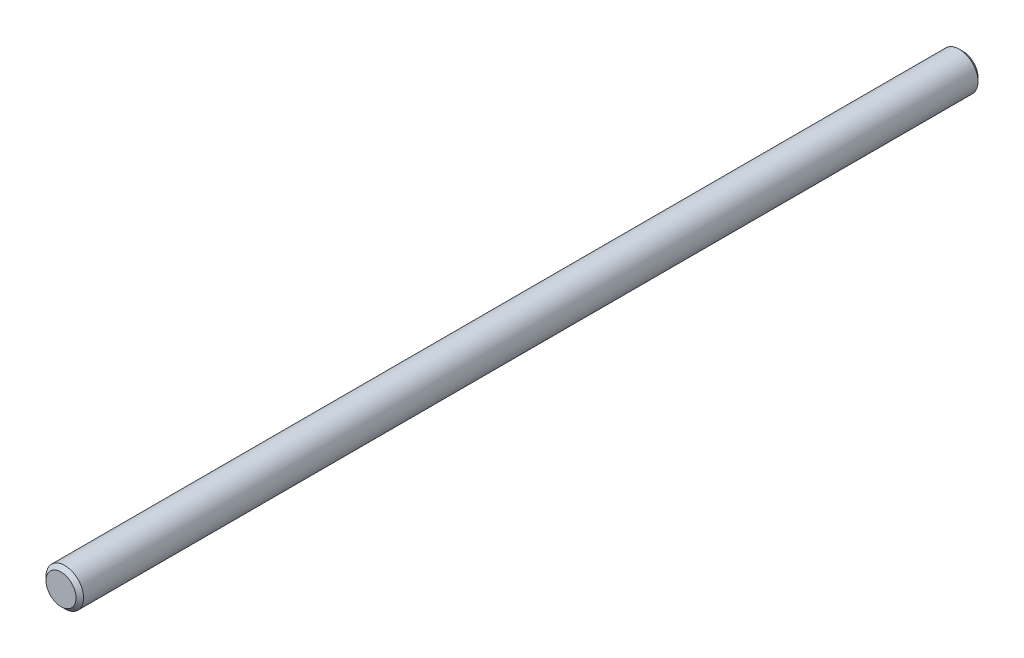
ISO-10303-21;
HEADER;
FILE_DESCRIPTION(('STEP AP214'),'2;1');
FILE_NAME('part.step','',(''),(''),'','','');
FILE_SCHEMA(('AUTOMOTIVE_DESIGN { 1 0 10303 214 1 1 1 1 }'));
ENDSEC;
DATA;
#1=APPLICATION_CONTEXT('core data for automotive mechanical design processes');
#2=APPLICATION_PROTOCOL_DEFINITION('international standard','automotive_design',2000,#1);
#3=PRODUCT_CONTEXT('',#1,'mechanical');
#4=PRODUCT('Part','Part','',(#3));
#5=PRODUCT_RELATED_PRODUCT_CATEGORY('part','',(#4));
#6=PRODUCT_DEFINITION_FORMATION('','',#4);
#7=PRODUCT_DEFINITION_CONTEXT('part definition',#1,'design');
#8=PRODUCT_DEFINITION('design','',#6,#7);
#9=PRODUCT_DEFINITION_SHAPE('','',#8);
#10=(LENGTH_UNIT() NAMED_UNIT(*) SI_UNIT(.MILLI.,.METRE.));
#11=(NAMED_UNIT(*) PLANE_ANGLE_UNIT() SI_UNIT($,.RADIAN.));
#12=(NAMED_UNIT(*) SI_UNIT($,.STERADIAN.) SOLID_ANGLE_UNIT());
#13=UNCERTAINTY_MEASURE_WITH_UNIT(LENGTH_MEASURE(1.E-05),#10,'distance_accuracy_value','');
#14=(GEOMETRIC_REPRESENTATION_CONTEXT(3) GLOBAL_UNCERTAINTY_ASSIGNED_CONTEXT((#13)) GLOBAL_UNIT_ASSIGNED_CONTEXT((#10,
#11,#12)) REPRESENTATION_CONTEXT('',''));
#15=CARTESIAN_POINT('',(0.,0.,0.));
#16=DIRECTION('',(0.,0.,1.));
#17=DIRECTION('',(1.,0.,0.));
#18=AXIS2_PLACEMENT_3D('',#15,#16,#17);
#19=CARTESIAN_POINT('',(0.,0.,76.2));
#20=DIRECTION('',(0.,0.,-1.));
#21=DIRECTION('',(-1.,0.,0.));
#22=AXIS2_PLACEMENT_3D('',#19,#20,#21);
#23=CYLINDRICAL_SURFACE('',#22,3.175);
#24=CARTESIAN_POINT('',(0.,0.,75.5650000000001));
#25=DIRECTION('',(0.,0.,1.));
#26=DIRECTION('',(1.,0.,0.));
#27=AXIS2_PLACEMENT_3D('',#24,#25,#26);
#28=CIRCLE('',#27,3.175);
#29=CARTESIAN_POINT('',(3.175,0.,75.5650000000001));
#30=VERTEX_POINT('',#29);
#31=EDGE_CURVE('E37',#30,#30,#28,.F.);
#32=ORIENTED_EDGE('',*,*,#31,.T.);
#33=EDGE_LOOP('',(#32));
#34=FACE_BOUND('',#33,.T.);
#35=CARTESIAN_POINT('',(0.,0.,-75.5649999999999));
#36=DIRECTION('',(0.,0.,1.));
#37=DIRECTION('',(1.,0.,0.));
#38=AXIS2_PLACEMENT_3D('',#35,#36,#37);
#39=CIRCLE('',#38,3.175);
#40=CARTESIAN_POINT('',(3.175,0.,-75.5649999999999));
#41=VERTEX_POINT('',#40);
#42=EDGE_CURVE('E41',#41,#41,#39,.T.);
#43=ORIENTED_EDGE('',*,*,#42,.T.);
#44=EDGE_LOOP('',(#43));
#45=FACE_BOUND('',#44,.T.);
#46=ADVANCED_FACE('F30',(#34,#45),#23,.T.);
#47=CARTESIAN_POINT('',(0.,0.,76.2));
#48=DIRECTION('',(0.,0.,1.));
#49=DIRECTION('',(1.,0.,0.));
#50=AXIS2_PLACEMENT_3D('',#47,#48,#49);
#51=PLANE('',#50);
#52=CARTESIAN_POINT('',(0.,0.,76.2));
#53=DIRECTION('',(0.,0.,1.));
#54=DIRECTION('',(1.,0.,0.));
#55=AXIS2_PLACEMENT_3D('',#52,#53,#54);
#56=CIRCLE('',#55,2.54000000000008);
#57=CARTESIAN_POINT('',(2.54000000000008,0.,76.2));
#58=VERTEX_POINT('',#57);
#59=EDGE_CURVE('E45',#58,#58,#56,.T.);
#60=ORIENTED_EDGE('',*,*,#59,.T.);
#61=EDGE_LOOP('',(#60));
#62=FACE_BOUND('',#61,.T.);
#63=ADVANCED_FACE('F51',(#62),#51,.T.);
#64=CARTESIAN_POINT('',(0.,0.,-76.2));
#65=DIRECTION('',(0.,0.,1.));
#66=DIRECTION('',(1.,0.,0.));
#67=AXIS2_PLACEMENT_3D('',#64,#65,#66);
#68=PLANE('',#67);
#69=CARTESIAN_POINT('',(0.,0.,-76.2));
#70=DIRECTION('',(0.,0.,1.));
#71=DIRECTION('',(1.,0.,0.));
#72=AXIS2_PLACEMENT_3D('',#69,#70,#71);
#73=CIRCLE('',#72,2.53999999999988);
#74=CARTESIAN_POINT('',(2.53999999999988,0.,-76.2));
#75=VERTEX_POINT('',#74);
#76=EDGE_CURVE('E10',#75,#75,#73,.F.);
#77=ORIENTED_EDGE('',*,*,#76,.T.);
#78=EDGE_LOOP('',(#77));
#79=FACE_BOUND('',#78,.T.);
#80=ADVANCED_FACE('F55',(#79),#68,.F.);
#81=CARTESIAN_POINT('',(0.,0.,76.2));
#82=DIRECTION('',(0.,0.,-1.));
#83=DIRECTION('',(-1.,0.,0.));
#84=AXIS2_PLACEMENT_3D('',#81,#82,#83);
#85=CONICAL_SURFACE('',#84,2.54000000000008,0.785398163397451);
#86=ORIENTED_EDGE('',*,*,#31,.F.);
#87=EDGE_LOOP('',(#86));
#88=FACE_BOUND('',#87,.T.);
#89=ORIENTED_EDGE('',*,*,#59,.F.);
#90=EDGE_LOOP('',(#89));
#91=FACE_BOUND('',#90,.T.);
#92=ADVANCED_FACE('F53',(#88,#91),#85,.T.);
#93=CARTESIAN_POINT('',(0.,0.,-75.5649999999999));
#94=DIRECTION('',(0.,0.,1.));
#95=DIRECTION('',(1.,0.,0.));
#96=AXIS2_PLACEMENT_3D('',#93,#94,#95);
#97=CONICAL_SURFACE('',#96,3.175,0.78539816339744);
#98=ORIENTED_EDGE('',*,*,#76,.F.);
#99=EDGE_LOOP('',(#98));
#100=FACE_BOUND('',#99,.T.);
#101=ORIENTED_EDGE('',*,*,#42,.F.);
#102=EDGE_LOOP('',(#101));
#103=FACE_BOUND('',#102,.T.);
#104=ADVANCED_FACE('F32',(#100,#103),#97,.T.);
#105=CLOSED_SHELL('',(#46,#63,#80,#92,#104));
#106=MANIFOLD_SOLID_BREP('B2',#105);
#107=ADVANCED_BREP_SHAPE_REPRESENTATION('',(#18,#106),#14);
#108=SHAPE_DEFINITION_REPRESENTATION(#9,#107);
ENDSEC;
END-ISO-10303-21;
